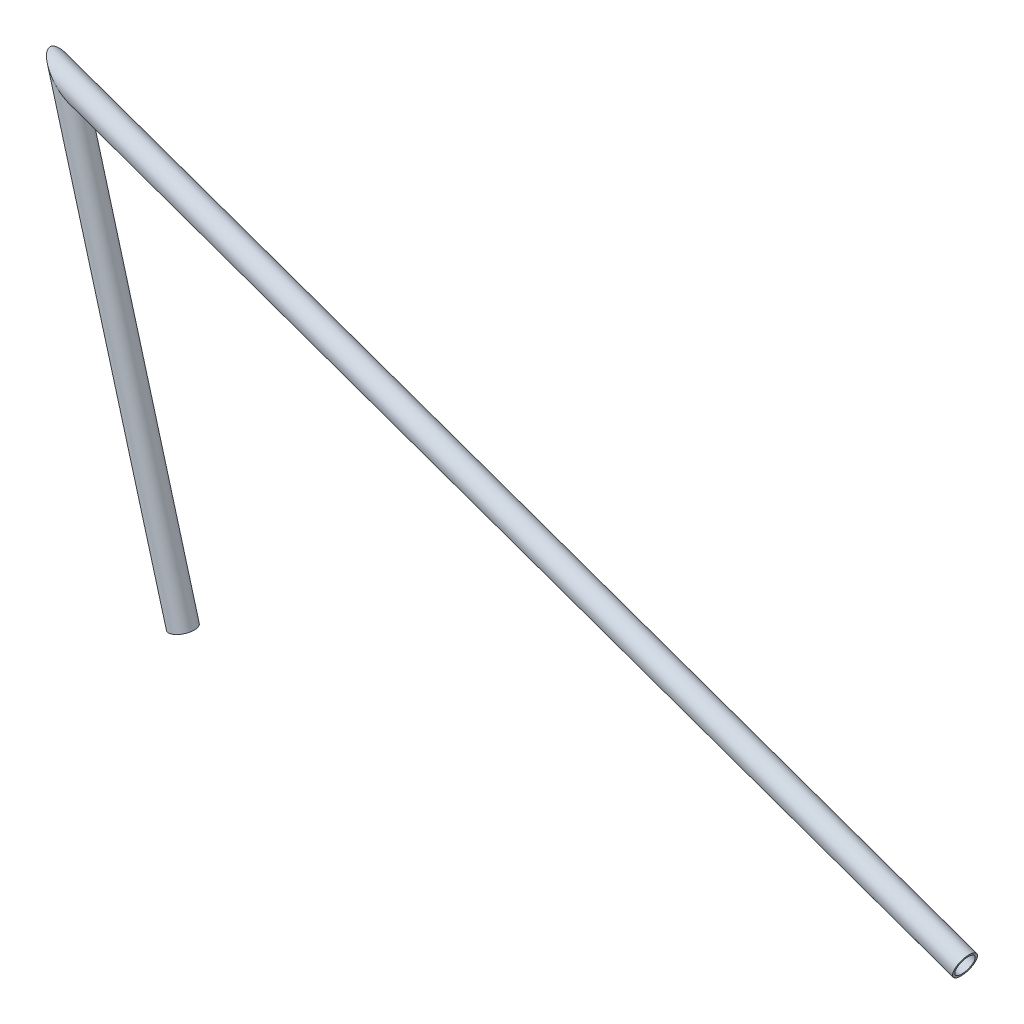
ISO-10303-21;
HEADER;
FILE_DESCRIPTION(('STEP AP214'),'2;1');
FILE_NAME('part.step','',(''),(''),'','','');
FILE_SCHEMA(('AUTOMOTIVE_DESIGN { 1 0 10303 214 1 1 1 1 }'));
ENDSEC;
DATA;
#1=APPLICATION_CONTEXT('core data for automotive mechanical design processes');
#2=APPLICATION_PROTOCOL_DEFINITION('international standard','automotive_design',2000,#1);
#3=PRODUCT_CONTEXT('',#1,'mechanical');
#4=PRODUCT('Part','Part','',(#3));
#5=PRODUCT_RELATED_PRODUCT_CATEGORY('part','',(#4));
#6=PRODUCT_DEFINITION_FORMATION('','',#4);
#7=PRODUCT_DEFINITION_CONTEXT('part definition',#1,'design');
#8=PRODUCT_DEFINITION('design','',#6,#7);
#9=PRODUCT_DEFINITION_SHAPE('','',#8);
#10=(LENGTH_UNIT() NAMED_UNIT(*) SI_UNIT(.MILLI.,.METRE.));
#11=(NAMED_UNIT(*) PLANE_ANGLE_UNIT() SI_UNIT($,.RADIAN.));
#12=(NAMED_UNIT(*) SI_UNIT($,.STERADIAN.) SOLID_ANGLE_UNIT());
#13=UNCERTAINTY_MEASURE_WITH_UNIT(LENGTH_MEASURE(1.E-05),#10,'distance_accuracy_value','');
#14=(GEOMETRIC_REPRESENTATION_CONTEXT(3) GLOBAL_UNCERTAINTY_ASSIGNED_CONTEXT((#13)) GLOBAL_UNIT_ASSIGNED_CONTEXT((#10,
#11,#12)) REPRESENTATION_CONTEXT('',''));
#15=CARTESIAN_POINT('',(0.,0.,0.));
#16=DIRECTION('',(0.,0.,1.));
#17=DIRECTION('',(1.,0.,0.));
#18=AXIS2_PLACEMENT_3D('',#15,#16,#17);
#19=CARTESIAN_POINT('',(0.,0.,0.));
#20=DIRECTION('',(0.942144182154576,-0.335207905682854,0.));
#21=DIRECTION('',(0.335207905682854,0.942144182154576,0.));
#22=AXIS2_PLACEMENT_3D('',#19,#20,#21);
#23=CYLINDRICAL_SURFACE('',#22,6.4643);
#24=CARTESIAN_POINT('',(599.498795794286,-213.297220960417,0.));
#25=DIRECTION('',(-0.942144182154576,0.335207905682854,0.));
#26=DIRECTION('',(-0.335207905682854,-0.942144182154576,0.));
#27=AXIS2_PLACEMENT_3D('',#24,#25,#26);
#28=CIRCLE('',#27,6.4643);
#29=CARTESIAN_POINT('',(597.331911329581,-219.387523597119,0.));
#30=VERTEX_POINT('',#29);
#31=EDGE_CURVE('E53',#30,#30,#28,.T.);
#32=ORIENTED_EDGE('',*,*,#31,.F.);
#33=EDGE_LOOP('',(#32));
#34=FACE_BOUND('',#33,.T.);
#35=CARTESIAN_POINT('',(0.,0.,0.));
#36=DIRECTION('',(-0.7322369511671,-0.681049959507751,0.));
#37=DIRECTION('',(0.681049959507751,-0.732236951167101,0.));
#38=AXIS2_PLACEMENT_3D('',#35,#36,#37);
#39=ELLIPSE('',#38,14.0047395074984,6.4643);
#40=CARTESIAN_POINT('',(9.53792727449843,-10.2547877588601,0.));
#41=VERTEX_POINT('',#40);
#42=EDGE_CURVE('E49',#41,#41,#39,.T.);
#43=ORIENTED_EDGE('',*,*,#42,.T.);
#44=EDGE_LOOP('',(#43));
#45=FACE_BOUND('',#44,.T.);
#46=ADVANCED_FACE('F45',(#34,#45),#23,.F.);
#47=CARTESIAN_POINT('',(0.,0.,0.));
#48=DIRECTION('',(0.942144182154576,-0.335207905682854,0.));
#49=DIRECTION('',(0.335207905682854,0.942144182154576,0.));
#50=AXIS2_PLACEMENT_3D('',#47,#48,#49);
#51=CYLINDRICAL_SURFACE('',#50,7.9375);
#52=CARTESIAN_POINT('',(599.498795794286,-213.297220960417,0.));
#53=DIRECTION('',(-0.942144182154576,0.335207905682854,0.));
#54=DIRECTION('',(-0.335207905682854,-0.942144182154576,0.));
#55=AXIS2_PLACEMENT_3D('',#52,#53,#54);
#56=CIRCLE('',#55,7.9375);
#57=CARTESIAN_POINT('',(596.838083042929,-220.775490406269,0.));
#58=VERTEX_POINT('',#57);
#59=EDGE_CURVE('E57',#58,#58,#56,.T.);
#60=ORIENTED_EDGE('',*,*,#59,.T.);
#61=EDGE_LOOP('',(#60));
#62=FACE_BOUND('',#61,.T.);
#63=CARTESIAN_POINT('',(0.,0.,0.));
#64=DIRECTION('',(-0.7322369511671,-0.681049959507751,0.));
#65=DIRECTION('',(0.681049959507751,-0.732236951167101,0.));
#66=AXIS2_PLACEMENT_3D('',#63,#64,#65);
#67=ELLIPSE('',#66,17.196389375612,7.9375);
#68=CARTESIAN_POINT('',(11.7116002879401,-12.5918317274805,0.));
#69=VERTEX_POINT('',#68);
#70=EDGE_CURVE('E12',#69,#69,#67,.T.);
#71=ORIENTED_EDGE('',*,*,#70,.F.);
#72=EDGE_LOOP('',(#71));
#73=FACE_BOUND('',#72,.T.);
#74=ADVANCED_FACE('F72',(#62,#73),#51,.T.);
#75=CARTESIAN_POINT('',(599.498795794286,-213.297220960417,0.));
#76=DIRECTION('',(-0.942144182154576,0.335207905682854,0.));
#77=DIRECTION('',(-0.335207905682854,-0.942144182154576,0.));
#78=AXIS2_PLACEMENT_3D('',#75,#76,#77);
#79=PLANE('',#78);
#80=ORIENTED_EDGE('',*,*,#31,.T.);
#81=EDGE_LOOP('',(#80));
#82=FACE_BOUND('',#81,.T.);
#83=ORIENTED_EDGE('',*,*,#59,.F.);
#84=EDGE_LOOP('',(#83));
#85=FACE_BOUND('',#84,.T.);
#86=ADVANCED_FACE('F68',(#82,#85),#79,.F.);
#87=CARTESIAN_POINT('',(0.,0.,0.));
#88=DIRECTION('',(-0.7322369511671,-0.681049959507751,0.));
#89=DIRECTION('',(0.681049959507751,-0.732236951167101,0.));
#90=AXIS2_PLACEMENT_3D('',#87,#88,#89);
#91=PLANE('',#90);
#92=ORIENTED_EDGE('',*,*,#42,.F.);
#93=EDGE_LOOP('',(#92));
#94=FACE_BOUND('',#93,.T.);
#95=ORIENTED_EDGE('',*,*,#70,.T.);
#96=EDGE_LOOP('',(#95));
#97=FACE_BOUND('',#96,.T.);
#98=ADVANCED_FACE('F47',(#94,#97),#91,.T.);
#99=CLOSED_SHELL('',(#46,#74,#86,#98));
#100=MANIFOLD_SOLID_BREP('B2',#99);
#101=CARTESIAN_POINT('',(76.9999999999997,-278.84950854667,0.));
#102=DIRECTION('',(-0.266173119516084,0.963925241109017,0.));
#103=DIRECTION('',(-0.963925241109017,-0.266173119516084,0.));
#104=AXIS2_PLACEMENT_3D('',#101,#102,#103);
#105=CYLINDRICAL_SURFACE('',#104,6.4643);
#106=CARTESIAN_POINT('',(76.9999999999997,-278.84950854667,0.));
#107=DIRECTION('',(0.266173119516084,-0.963925241109017,0.));
#108=DIRECTION('',(0.963925241109017,0.266173119516084,0.));
#109=AXIS2_PLACEMENT_3D('',#106,#107,#108);
#110=CIRCLE('',#109,6.4643);
#111=CARTESIAN_POINT('',(83.2311019361008,-277.128885650183,0.));
#112=VERTEX_POINT('',#111);
#113=EDGE_CURVE('E141',#112,#112,#110,.T.);
#114=ORIENTED_EDGE('',*,*,#113,.T.);
#115=EDGE_LOOP('',(#114));
#116=FACE_BOUND('',#115,.T.);
#117=CARTESIAN_POINT('',(0.,0.,0.));
#118=DIRECTION('',(0.732236951167101,0.681049959507751,0.));
#119=DIRECTION('',(-0.681049959507751,0.732236951167101,0.));
#120=AXIS2_PLACEMENT_3D('',#117,#118,#119);
#121=ELLIPSE('',#120,14.0047395074984,6.4643);
#122=CARTESIAN_POINT('',(-9.53792727449839,10.2547877588601,0.));
#123=VERTEX_POINT('',#122);
#124=EDGE_CURVE('E131',#123,#123,#121,.T.);
#125=ORIENTED_EDGE('',*,*,#124,.T.);
#126=EDGE_LOOP('',(#125));
#127=FACE_BOUND('',#126,.T.);
#128=ADVANCED_FACE('F127',(#116,#127),#105,.F.);
#129=CARTESIAN_POINT('',(76.9999999999997,-278.84950854667,0.));
#130=DIRECTION('',(-0.266173119516084,0.963925241109017,0.));
#131=DIRECTION('',(-0.963925241109017,-0.266173119516084,0.));
#132=AXIS2_PLACEMENT_3D('',#129,#130,#131);
#133=CYLINDRICAL_SURFACE('',#132,7.9375);
#134=CARTESIAN_POINT('',(76.9999999999997,-278.84950854667,0.));
#135=DIRECTION('',(0.266173119516084,-0.963925241109017,0.));
#136=DIRECTION('',(0.963925241109017,0.266173119516084,0.));
#137=AXIS2_PLACEMENT_3D('',#134,#135,#136);
#138=CIRCLE('',#137,7.9375);
#139=CARTESIAN_POINT('',(84.6511566013026,-276.736759410512,0.));
#140=VERTEX_POINT('',#139);
#141=EDGE_CURVE('E135',#140,#140,#138,.T.);
#142=ORIENTED_EDGE('',*,*,#141,.F.);
#143=EDGE_LOOP('',(#142));
#144=FACE_BOUND('',#143,.T.);
#145=CARTESIAN_POINT('',(0.,0.,0.));
#146=DIRECTION('',(0.732236951167101,0.681049959507751,0.));
#147=DIRECTION('',(-0.681049959507751,0.732236951167101,0.));
#148=AXIS2_PLACEMENT_3D('',#145,#146,#147);
#149=ELLIPSE('',#148,17.196389375612,7.9375);
#150=CARTESIAN_POINT('',(-11.7116002879401,12.5918317274805,0.));
#151=VERTEX_POINT('',#150);
#152=EDGE_CURVE('E44',#151,#151,#149,.T.);
#153=ORIENTED_EDGE('',*,*,#152,.F.);
#154=EDGE_LOOP('',(#153));
#155=FACE_BOUND('',#154,.T.);
#156=ADVANCED_FACE('F154',(#144,#155),#133,.T.);
#157=CARTESIAN_POINT('',(76.9999999999997,-278.84950854667,0.));
#158=DIRECTION('',(0.266173119516084,-0.963925241109017,0.));
#159=DIRECTION('',(0.963925241109017,0.266173119516084,0.));
#160=AXIS2_PLACEMENT_3D('',#157,#158,#159);
#161=PLANE('',#160);
#162=ORIENTED_EDGE('',*,*,#113,.F.);
#163=EDGE_LOOP('',(#162));
#164=FACE_BOUND('',#163,.T.);
#165=ORIENTED_EDGE('',*,*,#141,.T.);
#166=EDGE_LOOP('',(#165));
#167=FACE_BOUND('',#166,.T.);
#168=ADVANCED_FACE('F150',(#164,#167),#161,.T.);
#169=CARTESIAN_POINT('',(0.,0.,0.));
#170=DIRECTION('',(0.732236951167101,0.681049959507751,0.));
#171=DIRECTION('',(-0.681049959507751,0.732236951167101,0.));
#172=AXIS2_PLACEMENT_3D('',#169,#170,#171);
#173=PLANE('',#172);
#174=ORIENTED_EDGE('',*,*,#124,.F.);
#175=EDGE_LOOP('',(#174));
#176=FACE_BOUND('',#175,.T.);
#177=ORIENTED_EDGE('',*,*,#152,.T.);
#178=EDGE_LOOP('',(#177));
#179=FACE_BOUND('',#178,.T.);
#180=ADVANCED_FACE('F129',(#176,#179),#173,.T.);
#181=CLOSED_SHELL('',(#128,#156,#168,#180));
#182=MANIFOLD_SOLID_BREP('B7',#181);
#183=ADVANCED_BREP_SHAPE_REPRESENTATION('',(#18,#100,#182),#14);
#184=SHAPE_DEFINITION_REPRESENTATION(#9,#183);
ENDSEC;
END-ISO-10303-21;
